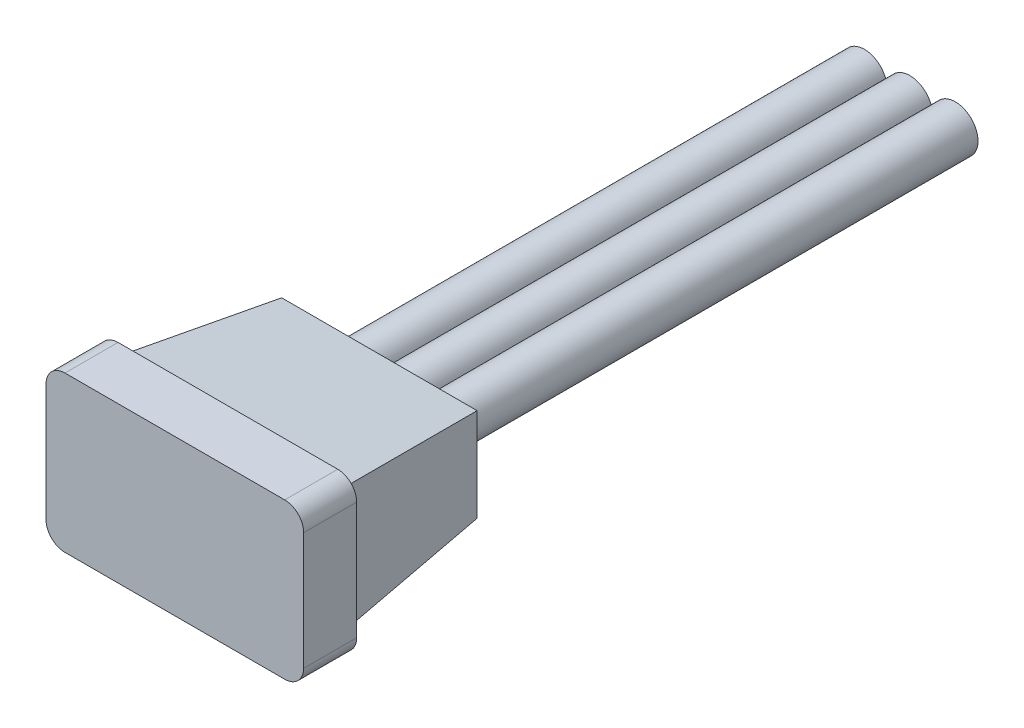
ISO-10303-21;
HEADER;
FILE_DESCRIPTION(('STEP AP214'),'2;1');
FILE_NAME('part.step','',(''),(''),'','','');
FILE_SCHEMA(('AUTOMOTIVE_DESIGN { 1 0 10303 214 1 1 1 1 }'));
ENDSEC;
DATA;
#1=APPLICATION_CONTEXT('core data for automotive mechanical design processes');
#2=APPLICATION_PROTOCOL_DEFINITION('international standard','automotive_design',2000,#1);
#3=PRODUCT_CONTEXT('',#1,'mechanical');
#4=PRODUCT('Part','Part','',(#3));
#5=PRODUCT_RELATED_PRODUCT_CATEGORY('part','',(#4));
#6=PRODUCT_DEFINITION_FORMATION('','',#4);
#7=PRODUCT_DEFINITION_CONTEXT('part definition',#1,'design');
#8=PRODUCT_DEFINITION('design','',#6,#7);
#9=PRODUCT_DEFINITION_SHAPE('','',#8);
#10=(LENGTH_UNIT() NAMED_UNIT(*) SI_UNIT(.MILLI.,.METRE.));
#11=(NAMED_UNIT(*) PLANE_ANGLE_UNIT() SI_UNIT($,.RADIAN.));
#12=(NAMED_UNIT(*) SI_UNIT($,.STERADIAN.) SOLID_ANGLE_UNIT());
#13=UNCERTAINTY_MEASURE_WITH_UNIT(LENGTH_MEASURE(1.E-05),#10,'distance_accuracy_value','');
#14=(GEOMETRIC_REPRESENTATION_CONTEXT(3) GLOBAL_UNCERTAINTY_ASSIGNED_CONTEXT((#13)) GLOBAL_UNIT_ASSIGNED_CONTEXT((#10,
#11,#12)) REPRESENTATION_CONTEXT('',''));
#15=CARTESIAN_POINT('',(0.,0.,0.));
#16=DIRECTION('',(0.,0.,1.));
#17=DIRECTION('',(1.,0.,0.));
#18=AXIS2_PLACEMENT_3D('',#15,#16,#17);
#19=CARTESIAN_POINT('',(1.2,0.,-21.0970562748477));
#20=DIRECTION('',(0.,0.,1.));
#21=DIRECTION('',(1.,0.,0.));
#22=AXIS2_PLACEMENT_3D('',#19,#20,#21);
#23=CYLINDRICAL_SURFACE('',#22,0.6);
#24=CARTESIAN_POINT('',(1.2,0.,-5.4));
#25=DIRECTION('',(0.,0.,-1.));
#26=DIRECTION('',(-1.,0.,0.));
#27=AXIS2_PLACEMENT_3D('',#24,#25,#26);
#28=CIRCLE('',#27,0.6);
#29=CARTESIAN_POINT('',(0.6,0.,-5.4));
#30=VERTEX_POINT('',#29);
#31=EDGE_CURVE('E52',#30,#30,#28,.T.);
#32=ORIENTED_EDGE('',*,*,#31,.T.);
#33=EDGE_LOOP('',(#32));
#34=FACE_BOUND('',#33,.T.);
#35=CARTESIAN_POINT('',(1.2,0.,-19.4));
#36=DIRECTION('',(0.,0.,-1.));
#37=DIRECTION('',(-1.,0.,0.));
#38=AXIS2_PLACEMENT_3D('',#35,#36,#37);
#39=CIRCLE('',#38,0.6);
#40=CARTESIAN_POINT('',(0.6,0.,-19.4));
#41=VERTEX_POINT('',#40);
#42=EDGE_CURVE('E11',#41,#41,#39,.T.);
#43=ORIENTED_EDGE('',*,*,#42,.F.);
#44=EDGE_LOOP('',(#43));
#45=FACE_BOUND('',#44,.T.);
#46=ADVANCED_FACE('F45',(#34,#45),#23,.T.);
#47=CARTESIAN_POINT('',(1.2,0.,-5.4));
#48=DIRECTION('',(0.,0.,-1.));
#49=DIRECTION('',(-1.,0.,0.));
#50=AXIS2_PLACEMENT_3D('',#47,#48,#49);
#51=PLANE('',#50);
#52=ORIENTED_EDGE('',*,*,#31,.F.);
#53=EDGE_LOOP('',(#52));
#54=FACE_BOUND('',#53,.T.);
#55=ADVANCED_FACE('F60',(#54),#51,.F.);
#56=CARTESIAN_POINT('',(0.,0.,-19.4));
#57=DIRECTION('',(0.,0.,-1.));
#58=DIRECTION('',(-1.,0.,0.));
#59=AXIS2_PLACEMENT_3D('',#56,#57,#58);
#60=PLANE('',#59);
#61=ORIENTED_EDGE('',*,*,#42,.T.);
#62=EDGE_LOOP('',(#61));
#63=FACE_BOUND('',#62,.T.);
#64=ADVANCED_FACE('F47',(#63),#60,.T.);
#65=CLOSED_SHELL('',(#46,#55,#64));
#66=MANIFOLD_SOLID_BREP('B2',#65);
#67=CARTESIAN_POINT('',(-1.2,0.,-21.0970562748477));
#68=DIRECTION('',(0.,0.,1.));
#69=DIRECTION('',(1.,0.,0.));
#70=AXIS2_PLACEMENT_3D('',#67,#68,#69);
#71=CYLINDRICAL_SURFACE('',#70,0.6);
#72=CARTESIAN_POINT('',(-1.2,0.,-5.4));
#73=DIRECTION('',(0.,0.,-1.));
#74=DIRECTION('',(-1.,0.,0.));
#75=AXIS2_PLACEMENT_3D('',#72,#73,#74);
#76=CIRCLE('',#75,0.6);
#77=CARTESIAN_POINT('',(-1.8,0.,-5.4));
#78=VERTEX_POINT('',#77);
#79=EDGE_CURVE('E101',#78,#78,#76,.T.);
#80=ORIENTED_EDGE('',*,*,#79,.T.);
#81=EDGE_LOOP('',(#80));
#82=FACE_BOUND('',#81,.T.);
#83=CARTESIAN_POINT('',(-1.2,0.,-19.4));
#84=DIRECTION('',(0.,0.,-1.));
#85=DIRECTION('',(-1.,0.,0.));
#86=AXIS2_PLACEMENT_3D('',#83,#84,#85);
#87=CIRCLE('',#86,0.6);
#88=CARTESIAN_POINT('',(-1.8,0.,-19.4));
#89=VERTEX_POINT('',#88);
#90=EDGE_CURVE('E44',#89,#89,#87,.T.);
#91=ORIENTED_EDGE('',*,*,#90,.F.);
#92=EDGE_LOOP('',(#91));
#93=FACE_BOUND('',#92,.T.);
#94=ADVANCED_FACE('F94',(#82,#93),#71,.T.);
#95=CARTESIAN_POINT('',(-1.2,0.,-5.4));
#96=DIRECTION('',(0.,0.,-1.));
#97=DIRECTION('',(-1.,0.,0.));
#98=AXIS2_PLACEMENT_3D('',#95,#96,#97);
#99=PLANE('',#98);
#100=ORIENTED_EDGE('',*,*,#79,.F.);
#101=EDGE_LOOP('',(#100));
#102=FACE_BOUND('',#101,.T.);
#103=ADVANCED_FACE('F109',(#102),#99,.F.);
#104=CARTESIAN_POINT('',(0.,0.,-19.4));
#105=DIRECTION('',(0.,0.,-1.));
#106=DIRECTION('',(-1.,0.,0.));
#107=AXIS2_PLACEMENT_3D('',#104,#105,#106);
#108=PLANE('',#107);
#109=ORIENTED_EDGE('',*,*,#90,.T.);
#110=EDGE_LOOP('',(#109));
#111=FACE_BOUND('',#110,.T.);
#112=ADVANCED_FACE('F96',(#111),#108,.T.);
#113=CLOSED_SHELL('',(#94,#103,#112));
#114=MANIFOLD_SOLID_BREP('B6',#113);
#115=CARTESIAN_POINT('',(0.,0.,-1.4));
#116=DIRECTION('',(0.,0.,1.));
#117=DIRECTION('',(1.,0.,0.));
#118=AXIS2_PLACEMENT_3D('',#115,#116,#117);
#119=PLANE('',#118);
#120=DIRECTION('',(1.,0.,0.));
#121=VECTOR('',#120,1.);
#122=CARTESIAN_POINT('',(-3.4,-2.05,-1.4));
#123=LINE('',#122,#121);
#124=CARTESIAN_POINT('',(-2.9,-2.05,-1.4));
#125=VERTEX_POINT('',#124);
#126=CARTESIAN_POINT('',(2.9,-2.05,-1.4));
#127=VERTEX_POINT('',#126);
#128=EDGE_CURVE('E271',#125,#127,#123,.T.);
#129=ORIENTED_EDGE('',*,*,#128,.F.);
#130=CARTESIAN_POINT('',(-2.9,-1.55,-1.4));
#131=DIRECTION('',(0.,0.,1.));
#132=DIRECTION('',(1.,0.,0.));
#133=AXIS2_PLACEMENT_3D('',#130,#131,#132);
#134=CIRCLE('',#133,0.5);
#135=CARTESIAN_POINT('',(-3.4,-1.55,-1.4));
#136=VERTEX_POINT('',#135);
#137=EDGE_CURVE('E308',#125,#136,#134,.F.);
#138=ORIENTED_EDGE('',*,*,#137,.T.);
#139=DIRECTION('',(0.,-1.,0.));
#140=VECTOR('',#139,1.);
#141=CARTESIAN_POINT('',(-3.4,2.05,-1.4));
#142=LINE('',#141,#140);
#143=CARTESIAN_POINT('',(-3.4,1.55,-1.4));
#144=VERTEX_POINT('',#143);
#145=EDGE_CURVE('E268',#144,#136,#142,.T.);
#146=ORIENTED_EDGE('',*,*,#145,.F.);
#147=CARTESIAN_POINT('',(-2.9,1.55,-1.4));
#148=DIRECTION('',(0.,0.,1.));
#149=DIRECTION('',(1.,0.,0.));
#150=AXIS2_PLACEMENT_3D('',#147,#148,#149);
#151=CIRCLE('',#150,0.5);
#152=CARTESIAN_POINT('',(-2.9,2.05,-1.4));
#153=VERTEX_POINT('',#152);
#154=EDGE_CURVE('E149',#144,#153,#151,.F.);
#155=ORIENTED_EDGE('',*,*,#154,.T.);
#156=DIRECTION('',(-1.,0.,0.));
#157=VECTOR('',#156,1.);
#158=CARTESIAN_POINT('',(-3.4,2.05,-1.4));
#159=LINE('',#158,#157);
#160=CARTESIAN_POINT('',(2.9,2.05,-1.4));
#161=VERTEX_POINT('',#160);
#162=EDGE_CURVE('E265',#161,#153,#159,.T.);
#163=ORIENTED_EDGE('',*,*,#162,.F.);
#164=CARTESIAN_POINT('',(2.9,1.55,-1.4));
#165=DIRECTION('',(0.,0.,1.));
#166=DIRECTION('',(1.,0.,0.));
#167=AXIS2_PLACEMENT_3D('',#164,#165,#166);
#168=CIRCLE('',#167,0.5);
#169=CARTESIAN_POINT('',(3.4,1.55,-1.4));
#170=VERTEX_POINT('',#169);
#171=EDGE_CURVE('E303',#161,#170,#168,.F.);
#172=ORIENTED_EDGE('',*,*,#171,.T.);
#173=DIRECTION('',(0.,1.,0.));
#174=VECTOR('',#173,1.);
#175=CARTESIAN_POINT('',(3.4,2.05,-1.4));
#176=LINE('',#175,#174);
#177=CARTESIAN_POINT('',(3.4,-1.55,-1.4));
#178=VERTEX_POINT('',#177);
#179=EDGE_CURVE('E262',#178,#170,#176,.T.);
#180=ORIENTED_EDGE('',*,*,#179,.F.);
#181=CARTESIAN_POINT('',(2.9,-1.55,-1.4));
#182=DIRECTION('',(0.,0.,1.));
#183=DIRECTION('',(1.,0.,0.));
#184=AXIS2_PLACEMENT_3D('',#181,#182,#183);
#185=CIRCLE('',#184,0.5);
#186=EDGE_CURVE('E305',#178,#127,#185,.F.);
#187=ORIENTED_EDGE('',*,*,#186,.T.);
#188=EDGE_LOOP('',(#129,#138,#146,#155,#163,#172,#180,#187));
#189=FACE_BOUND('',#188,.T.);
#190=DIRECTION('',(1.,0.,0.));
#191=VECTOR('',#190,1.);
#192=CARTESIAN_POINT('',(-3.,1.65,-1.4));
#193=LINE('',#192,#191);
#194=CARTESIAN_POINT('',(-3.,1.65,-1.4));
#195=VERTEX_POINT('',#194);
#196=CARTESIAN_POINT('',(3.,1.65,-1.4));
#197=VERTEX_POINT('',#196);
#198=EDGE_CURVE('E242',#195,#197,#193,.T.);
#199=ORIENTED_EDGE('',*,*,#198,.F.);
#200=DIRECTION('',(0.,1.,0.));
#201=VECTOR('',#200,1.);
#202=CARTESIAN_POINT('',(-3.,-1.65,-1.4));
#203=LINE('',#202,#201);
#204=CARTESIAN_POINT('',(-3.,-1.65,-1.4));
#205=VERTEX_POINT('',#204);
#206=EDGE_CURVE('E228',#205,#195,#203,.T.);
#207=ORIENTED_EDGE('',*,*,#206,.F.);
#208=DIRECTION('',(-1.,0.,0.));
#209=VECTOR('',#208,1.);
#210=CARTESIAN_POINT('',(3.,-1.65,-1.4));
#211=LINE('',#210,#209);
#212=CARTESIAN_POINT('',(3.,-1.65,-1.4));
#213=VERTEX_POINT('',#212);
#214=EDGE_CURVE('E223',#213,#205,#211,.T.);
#215=ORIENTED_EDGE('',*,*,#214,.F.);
#216=DIRECTION('',(0.,-1.,0.));
#217=VECTOR('',#216,1.);
#218=CARTESIAN_POINT('',(3.,1.65,-1.4));
#219=LINE('',#218,#217);
#220=EDGE_CURVE('E225',#197,#213,#219,.T.);
#221=ORIENTED_EDGE('',*,*,#220,.F.);
#222=EDGE_LOOP('',(#199,#207,#215,#221));
#223=FACE_BOUND('',#222,.T.);
#224=ADVANCED_FACE('F134',(#189,#223),#119,.F.);
#225=CARTESIAN_POINT('',(3.4,2.05,-1.4));
#226=DIRECTION('',(1.,0.,0.));
#227=DIRECTION('',(0.,1.,0.));
#228=AXIS2_PLACEMENT_3D('',#225,#226,#227);
#229=PLANE('',#228);
#230=DIRECTION('',(0.,1.,0.));
#231=VECTOR('',#230,1.);
#232=CARTESIAN_POINT('',(3.4,2.05,0.));
#233=LINE('',#232,#231);
#234=CARTESIAN_POINT('',(3.4,-1.55,0.));
#235=VERTEX_POINT('',#234);
#236=CARTESIAN_POINT('',(3.4,1.55,0.));
#237=VERTEX_POINT('',#236);
#238=EDGE_CURVE('E248',#235,#237,#233,.T.);
#239=ORIENTED_EDGE('',*,*,#238,.F.);
#240=DIRECTION('',(0.,0.,1.));
#241=VECTOR('',#240,1.);
#242=CARTESIAN_POINT('',(3.4,-1.55,-1.4));
#243=LINE('',#242,#241);
#244=EDGE_CURVE('E92',#235,#178,#243,.F.);
#245=ORIENTED_EDGE('',*,*,#244,.T.);
#246=ORIENTED_EDGE('',*,*,#179,.T.);
#247=DIRECTION('',(0.,0.,1.));
#248=VECTOR('',#247,1.);
#249=CARTESIAN_POINT('',(3.4,1.55,-1.4));
#250=LINE('',#249,#248);
#251=EDGE_CURVE('E142',#170,#237,#250,.T.);
#252=ORIENTED_EDGE('',*,*,#251,.T.);
#253=EDGE_LOOP('',(#239,#245,#246,#252));
#254=FACE_BOUND('',#253,.T.);
#255=ADVANCED_FACE('F317',(#254),#229,.T.);
#256=CARTESIAN_POINT('',(-3.4,-2.05,-1.4));
#257=DIRECTION('',(0.,-1.,0.));
#258=DIRECTION('',(0.,0.,-1.));
#259=AXIS2_PLACEMENT_3D('',#256,#257,#258);
#260=PLANE('',#259);
#261=DIRECTION('',(1.,0.,0.));
#262=VECTOR('',#261,1.);
#263=CARTESIAN_POINT('',(-3.4,-2.05,0.));
#264=LINE('',#263,#262);
#265=CARTESIAN_POINT('',(-2.9,-2.05,0.));
#266=VERTEX_POINT('',#265);
#267=CARTESIAN_POINT('',(2.9,-2.05,0.));
#268=VERTEX_POINT('',#267);
#269=EDGE_CURVE('E266',#266,#268,#264,.T.);
#270=ORIENTED_EDGE('',*,*,#269,.F.);
#271=DIRECTION('',(0.,0.,1.));
#272=VECTOR('',#271,1.);
#273=CARTESIAN_POINT('',(-2.9,-2.05,-1.4));
#274=LINE('',#273,#272);
#275=EDGE_CURVE('E301',#266,#125,#274,.F.);
#276=ORIENTED_EDGE('',*,*,#275,.T.);
#277=ORIENTED_EDGE('',*,*,#128,.T.);
#278=DIRECTION('',(0.,0.,1.));
#279=VECTOR('',#278,1.);
#280=CARTESIAN_POINT('',(2.9,-2.05,-1.4));
#281=LINE('',#280,#279);
#282=EDGE_CURVE('E298',#127,#268,#281,.T.);
#283=ORIENTED_EDGE('',*,*,#282,.T.);
#284=EDGE_LOOP('',(#270,#276,#277,#283));
#285=FACE_BOUND('',#284,.T.);
#286=ADVANCED_FACE('F330',(#285),#260,.T.);
#287=CARTESIAN_POINT('',(-3.4,2.05,-1.4));
#288=DIRECTION('',(-1.,0.,0.));
#289=DIRECTION('',(0.,-1.,0.));
#290=AXIS2_PLACEMENT_3D('',#287,#288,#289);
#291=PLANE('',#290);
#292=ORIENTED_EDGE('',*,*,#145,.T.);
#293=DIRECTION('',(0.,0.,1.));
#294=VECTOR('',#293,1.);
#295=CARTESIAN_POINT('',(-3.4,-1.55,-1.4));
#296=LINE('',#295,#294);
#297=CARTESIAN_POINT('',(-3.4,-1.55,0.));
#298=VERTEX_POINT('',#297);
#299=EDGE_CURVE('E287',#136,#298,#296,.T.);
#300=ORIENTED_EDGE('',*,*,#299,.T.);
#301=DIRECTION('',(0.,-1.,0.));
#302=VECTOR('',#301,1.);
#303=CARTESIAN_POINT('',(-3.4,2.05,0.));
#304=LINE('',#303,#302);
#305=CARTESIAN_POINT('',(-3.4,1.55,0.));
#306=VERTEX_POINT('',#305);
#307=EDGE_CURVE('E280',#306,#298,#304,.T.);
#308=ORIENTED_EDGE('',*,*,#307,.F.);
#309=DIRECTION('',(0.,0.,1.));
#310=VECTOR('',#309,1.);
#311=CARTESIAN_POINT('',(-3.4,1.55,-1.4));
#312=LINE('',#311,#310);
#313=EDGE_CURVE('E285',#306,#144,#312,.F.);
#314=ORIENTED_EDGE('',*,*,#313,.T.);
#315=EDGE_LOOP('',(#292,#300,#308,#314));
#316=FACE_BOUND('',#315,.T.);
#317=ADVANCED_FACE('F339',(#316),#291,.T.);
#318=CARTESIAN_POINT('',(-3.4,2.05,-1.4));
#319=DIRECTION('',(0.,1.,0.));
#320=DIRECTION('',(0.,0.,1.));
#321=AXIS2_PLACEMENT_3D('',#318,#319,#320);
#322=PLANE('',#321);
#323=ORIENTED_EDGE('',*,*,#162,.T.);
#324=DIRECTION('',(0.,0.,1.));
#325=VECTOR('',#324,1.);
#326=CARTESIAN_POINT('',(-2.9,2.05,-1.4));
#327=LINE('',#326,#325);
#328=CARTESIAN_POINT('',(-2.9,2.05,0.));
#329=VERTEX_POINT('',#328);
#330=EDGE_CURVE('E311',#153,#329,#327,.T.);
#331=ORIENTED_EDGE('',*,*,#330,.T.);
#332=DIRECTION('',(-1.,0.,0.));
#333=VECTOR('',#332,1.);
#334=CARTESIAN_POINT('',(-3.4,2.05,0.));
#335=LINE('',#334,#333);
#336=CARTESIAN_POINT('',(2.9,2.05,0.));
#337=VERTEX_POINT('',#336);
#338=EDGE_CURVE('E277',#337,#329,#335,.T.);
#339=ORIENTED_EDGE('',*,*,#338,.F.);
#340=DIRECTION('',(0.,0.,1.));
#341=VECTOR('',#340,1.);
#342=CARTESIAN_POINT('',(2.9,2.05,-1.4));
#343=LINE('',#342,#341);
#344=EDGE_CURVE('E156',#337,#161,#343,.F.);
#345=ORIENTED_EDGE('',*,*,#344,.T.);
#346=EDGE_LOOP('',(#323,#331,#339,#345));
#347=FACE_BOUND('',#346,.T.);
#348=ADVANCED_FACE('F344',(#347),#322,.T.);
#349=CARTESIAN_POINT('',(0.,0.,0.));
#350=DIRECTION('',(0.,0.,1.));
#351=DIRECTION('',(1.,0.,0.));
#352=AXIS2_PLACEMENT_3D('',#349,#350,#351);
#353=PLANE('',#352);
#354=ORIENTED_EDGE('',*,*,#307,.T.);
#355=CARTESIAN_POINT('',(-2.9,-1.55,0.));
#356=DIRECTION('',(0.,0.,1.));
#357=DIRECTION('',(1.,0.,0.));
#358=AXIS2_PLACEMENT_3D('',#355,#356,#357);
#359=CIRCLE('',#358,0.5);
#360=EDGE_CURVE('E296',#298,#266,#359,.T.);
#361=ORIENTED_EDGE('',*,*,#360,.T.);
#362=ORIENTED_EDGE('',*,*,#269,.T.);
#363=CARTESIAN_POINT('',(2.9,-1.55,0.));
#364=DIRECTION('',(0.,0.,1.));
#365=DIRECTION('',(1.,0.,0.));
#366=AXIS2_PLACEMENT_3D('',#363,#364,#365);
#367=CIRCLE('',#366,0.5);
#368=EDGE_CURVE('E292',#268,#235,#367,.T.);
#369=ORIENTED_EDGE('',*,*,#368,.T.);
#370=ORIENTED_EDGE('',*,*,#238,.T.);
#371=CARTESIAN_POINT('',(2.9,1.55,0.));
#372=DIRECTION('',(0.,0.,1.));
#373=DIRECTION('',(1.,0.,0.));
#374=AXIS2_PLACEMENT_3D('',#371,#372,#373);
#375=CIRCLE('',#374,0.5);
#376=EDGE_CURVE('E290',#237,#337,#375,.T.);
#377=ORIENTED_EDGE('',*,*,#376,.T.);
#378=ORIENTED_EDGE('',*,*,#338,.T.);
#379=CARTESIAN_POINT('',(-2.9,1.55,0.));
#380=DIRECTION('',(0.,0.,1.));
#381=DIRECTION('',(1.,0.,0.));
#382=AXIS2_PLACEMENT_3D('',#379,#380,#381);
#383=CIRCLE('',#382,0.5);
#384=EDGE_CURVE('E294',#329,#306,#383,.T.);
#385=ORIENTED_EDGE('',*,*,#384,.T.);
#386=EDGE_LOOP('',(#354,#361,#362,#369,#370,#377,#378,#385));
#387=FACE_BOUND('',#386,.T.);
#388=ADVANCED_FACE('F323',(#387),#353,.T.);
#389=CARTESIAN_POINT('',(-3.,1.65,-1.4));
#390=DIRECTION('',(0.,0.994521895368273,-0.104528463267654));
#391=DIRECTION('',(0.,0.104528463267654,0.994521895368273));
#392=AXIS2_PLACEMENT_3D('',#389,#390,#391);
#393=PLANE('',#392);
#394=ORIENTED_EDGE('',*,*,#198,.T.);
#395=DIRECTION('',(0.103962051184498,0.103962051184498,0.989132844377854));
#396=VECTOR('',#395,1.);
#397=CARTESIAN_POINT('',(3.,1.65,-1.4));
#398=LINE('',#397,#396);
#399=CARTESIAN_POINT('',(2.57958305893729,1.22958305893729,-5.4));
#400=VERTEX_POINT('',#399);
#401=EDGE_CURVE('E240',#400,#197,#398,.T.);
#402=ORIENTED_EDGE('',*,*,#401,.F.);
#403=DIRECTION('',(-1.,0.,0.));
#404=VECTOR('',#403,1.);
#405=CARTESIAN_POINT('',(-3.,1.22958305893729,-5.4));
#406=LINE('',#405,#404);
#407=CARTESIAN_POINT('',(-2.57958305893729,1.22958305893729,-5.4));
#408=VERTEX_POINT('',#407);
#409=EDGE_CURVE('E254',#408,#400,#406,.F.);
#410=ORIENTED_EDGE('',*,*,#409,.F.);
#411=DIRECTION('',(-0.103962051184498,0.103962051184498,0.989132844377854));
#412=VECTOR('',#411,1.);
#413=CARTESIAN_POINT('',(-3.,1.65,-1.4));
#414=LINE('',#413,#412);
#415=EDGE_CURVE('E250',#408,#195,#414,.T.);
#416=ORIENTED_EDGE('',*,*,#415,.T.);
#417=EDGE_LOOP('',(#394,#402,#410,#416));
#418=FACE_BOUND('',#417,.T.);
#419=ADVANCED_FACE('F360',(#418),#393,.T.);
#420=CARTESIAN_POINT('',(3.,1.65,-1.4));
#421=DIRECTION('',(0.994521895368273,0.,-0.104528463267654));
#422=DIRECTION('',(-0.104528463267654,0.,-0.994521895368273));
#423=AXIS2_PLACEMENT_3D('',#420,#421,#422);
#424=PLANE('',#423);
#425=ORIENTED_EDGE('',*,*,#220,.T.);
#426=DIRECTION('',(0.103962051184498,-0.103962051184498,0.989132844377854));
#427=VECTOR('',#426,1.);
#428=CARTESIAN_POINT('',(3.,-1.65,-1.4));
#429=LINE('',#428,#427);
#430=CARTESIAN_POINT('',(2.57958305893729,-1.22958305893729,-5.4));
#431=VERTEX_POINT('',#430);
#432=EDGE_CURVE('E237',#431,#213,#429,.T.);
#433=ORIENTED_EDGE('',*,*,#432,.F.);
#434=DIRECTION('',(0.,1.,0.));
#435=VECTOR('',#434,1.);
#436=CARTESIAN_POINT('',(2.57958305893729,1.65,-5.4));
#437=LINE('',#436,#435);
#438=EDGE_CURVE('E257',#400,#431,#437,.F.);
#439=ORIENTED_EDGE('',*,*,#438,.F.);
#440=ORIENTED_EDGE('',*,*,#401,.T.);
#441=EDGE_LOOP('',(#425,#433,#439,#440));
#442=FACE_BOUND('',#441,.T.);
#443=ADVANCED_FACE('F236',(#442),#424,.T.);
#444=CARTESIAN_POINT('',(3.,-1.65,-1.4));
#445=DIRECTION('',(0.,-0.994521895368273,-0.104528463267654));
#446=DIRECTION('',(0.,0.104528463267654,-0.994521895368273));
#447=AXIS2_PLACEMENT_3D('',#444,#445,#446);
#448=PLANE('',#447);
#449=ORIENTED_EDGE('',*,*,#214,.T.);
#450=DIRECTION('',(-0.103962051184498,-0.103962051184498,0.989132844377854));
#451=VECTOR('',#450,1.);
#452=CARTESIAN_POINT('',(-3.,-1.65,-1.4));
#453=LINE('',#452,#451);
#454=CARTESIAN_POINT('',(-2.57958305893729,-1.22958305893729,-5.4));
#455=VERTEX_POINT('',#454);
#456=EDGE_CURVE('E246',#455,#205,#453,.T.);
#457=ORIENTED_EDGE('',*,*,#456,.F.);
#458=DIRECTION('',(1.,0.,0.));
#459=VECTOR('',#458,1.);
#460=CARTESIAN_POINT('',(3.,-1.22958305893729,-5.4));
#461=LINE('',#460,#459);
#462=EDGE_CURVE('E245',#431,#455,#461,.F.);
#463=ORIENTED_EDGE('',*,*,#462,.F.);
#464=ORIENTED_EDGE('',*,*,#432,.T.);
#465=EDGE_LOOP('',(#449,#457,#463,#464));
#466=FACE_BOUND('',#465,.T.);
#467=ADVANCED_FACE('F244',(#466),#448,.T.);
#468=CARTESIAN_POINT('',(-3.,-1.65,-1.4));
#469=DIRECTION('',(-0.994521895368273,0.,-0.104528463267654));
#470=DIRECTION('',(-0.104528463267654,0.,0.994521895368273));
#471=AXIS2_PLACEMENT_3D('',#468,#469,#470);
#472=PLANE('',#471);
#473=ORIENTED_EDGE('',*,*,#206,.T.);
#474=ORIENTED_EDGE('',*,*,#415,.F.);
#475=DIRECTION('',(0.,-1.,0.));
#476=VECTOR('',#475,1.);
#477=CARTESIAN_POINT('',(-2.57958305893729,-1.65,-5.4));
#478=LINE('',#477,#476);
#479=EDGE_CURVE('E260',#455,#408,#478,.F.);
#480=ORIENTED_EDGE('',*,*,#479,.F.);
#481=ORIENTED_EDGE('',*,*,#456,.T.);
#482=EDGE_LOOP('',(#473,#474,#480,#481));
#483=FACE_BOUND('',#482,.T.);
#484=ADVANCED_FACE('F418',(#483),#472,.T.);
#485=CARTESIAN_POINT('',(0.,0.,-5.4));
#486=DIRECTION('',(0.,0.,-1.));
#487=DIRECTION('',(-1.,0.,0.));
#488=AXIS2_PLACEMENT_3D('',#485,#486,#487);
#489=PLANE('',#488);
#490=CARTESIAN_POINT('',(0.,0.,-5.4));
#491=DIRECTION('',(0.,0.,-1.));
#492=DIRECTION('',(-1.,0.,0.));
#493=AXIS2_PLACEMENT_3D('',#490,#491,#492);
#494=CIRCLE('',#493,0.6);
#495=CARTESIAN_POINT('',(-0.6,0.,-5.4));
#496=VERTEX_POINT('',#495);
#497=EDGE_CURVE('E274',#496,#496,#494,.T.);
#498=ORIENTED_EDGE('',*,*,#497,.F.);
#499=EDGE_LOOP('',(#498));
#500=FACE_BOUND('',#499,.T.);
#501=ORIENTED_EDGE('',*,*,#409,.T.);
#502=ORIENTED_EDGE('',*,*,#438,.T.);
#503=ORIENTED_EDGE('',*,*,#462,.T.);
#504=ORIENTED_EDGE('',*,*,#479,.T.);
#505=EDGE_LOOP('',(#501,#502,#503,#504));
#506=FACE_BOUND('',#505,.T.);
#507=ADVANCED_FACE('F409',(#500,#506),#489,.T.);
#508=CARTESIAN_POINT('',(0.,0.,-19.4));
#509=DIRECTION('',(0.,0.,1.));
#510=DIRECTION('',(1.,0.,0.));
#511=AXIS2_PLACEMENT_3D('',#508,#509,#510);
#512=CYLINDRICAL_SURFACE('',#511,0.6);
#513=CARTESIAN_POINT('',(0.,0.,-19.4));
#514=DIRECTION('',(0.,0.,-1.));
#515=DIRECTION('',(-1.,0.,0.));
#516=AXIS2_PLACEMENT_3D('',#513,#514,#515);
#517=CIRCLE('',#516,0.6);
#518=CARTESIAN_POINT('',(-0.6,0.,-19.4));
#519=VERTEX_POINT('',#518);
#520=EDGE_CURVE('E492',#519,#519,#517,.T.);
#521=ORIENTED_EDGE('',*,*,#520,.F.);
#522=EDGE_LOOP('',(#521));
#523=FACE_BOUND('',#522,.T.);
#524=ORIENTED_EDGE('',*,*,#497,.T.);
#525=EDGE_LOOP('',(#524));
#526=FACE_BOUND('',#525,.T.);
#527=ADVANCED_FACE('F400',(#523,#526),#512,.T.);
#528=CARTESIAN_POINT('',(0.,0.,-19.4));
#529=DIRECTION('',(0.,0.,-1.));
#530=DIRECTION('',(-1.,0.,0.));
#531=AXIS2_PLACEMENT_3D('',#528,#529,#530);
#532=PLANE('',#531);
#533=ORIENTED_EDGE('',*,*,#520,.T.);
#534=EDGE_LOOP('',(#533));
#535=FACE_BOUND('',#534,.T.);
#536=ADVANCED_FACE('F369',(#535),#532,.T.);
#537=CARTESIAN_POINT('',(-2.9,-1.55,-1.4));
#538=DIRECTION('',(0.,0.,1.));
#539=DIRECTION('',(1.,0.,0.));
#540=AXIS2_PLACEMENT_3D('',#537,#538,#539);
#541=CYLINDRICAL_SURFACE('',#540,0.5);
#542=ORIENTED_EDGE('',*,*,#137,.F.);
#543=ORIENTED_EDGE('',*,*,#275,.F.);
#544=ORIENTED_EDGE('',*,*,#360,.F.);
#545=ORIENTED_EDGE('',*,*,#299,.F.);
#546=EDGE_LOOP('',(#542,#543,#544,#545));
#547=FACE_BOUND('',#546,.T.);
#548=ADVANCED_FACE('F336',(#547),#541,.T.);
#549=CARTESIAN_POINT('',(-2.9,1.55,-1.4));
#550=DIRECTION('',(0.,0.,1.));
#551=DIRECTION('',(1.,0.,0.));
#552=AXIS2_PLACEMENT_3D('',#549,#550,#551);
#553=CYLINDRICAL_SURFACE('',#552,0.5);
#554=ORIENTED_EDGE('',*,*,#154,.F.);
#555=ORIENTED_EDGE('',*,*,#313,.F.);
#556=ORIENTED_EDGE('',*,*,#384,.F.);
#557=ORIENTED_EDGE('',*,*,#330,.F.);
#558=EDGE_LOOP('',(#554,#555,#556,#557));
#559=FACE_BOUND('',#558,.T.);
#560=ADVANCED_FACE('F343',(#559),#553,.T.);
#561=CARTESIAN_POINT('',(2.9,-1.55,-1.4));
#562=DIRECTION('',(0.,0.,1.));
#563=DIRECTION('',(1.,0.,0.));
#564=AXIS2_PLACEMENT_3D('',#561,#562,#563);
#565=CYLINDRICAL_SURFACE('',#564,0.5);
#566=ORIENTED_EDGE('',*,*,#186,.F.);
#567=ORIENTED_EDGE('',*,*,#244,.F.);
#568=ORIENTED_EDGE('',*,*,#368,.F.);
#569=ORIENTED_EDGE('',*,*,#282,.F.);
#570=EDGE_LOOP('',(#566,#567,#568,#569));
#571=FACE_BOUND('',#570,.T.);
#572=ADVANCED_FACE('F328',(#571),#565,.T.);
#573=CARTESIAN_POINT('',(2.9,1.55,-1.4));
#574=DIRECTION('',(0.,0.,1.));
#575=DIRECTION('',(1.,0.,0.));
#576=AXIS2_PLACEMENT_3D('',#573,#574,#575);
#577=CYLINDRICAL_SURFACE('',#576,0.5);
#578=ORIENTED_EDGE('',*,*,#171,.F.);
#579=ORIENTED_EDGE('',*,*,#344,.F.);
#580=ORIENTED_EDGE('',*,*,#376,.F.);
#581=ORIENTED_EDGE('',*,*,#251,.F.);
#582=EDGE_LOOP('',(#578,#579,#580,#581));
#583=FACE_BOUND('',#582,.T.);
#584=ADVANCED_FACE('F136',(#583),#577,.T.);
#585=CLOSED_SHELL('',(#224,#255,#286,#317,#348,#388,#419,#443,#467,#484,#507,#527,#536,#548,
#560,#572,#584));
#586=MANIFOLD_SOLID_BREP('B39',#585);
#587=ADVANCED_BREP_SHAPE_REPRESENTATION('',(#18,#66,#114,#586),#14);
#588=SHAPE_DEFINITION_REPRESENTATION(#9,#587);
ENDSEC;
END-ISO-10303-21;
